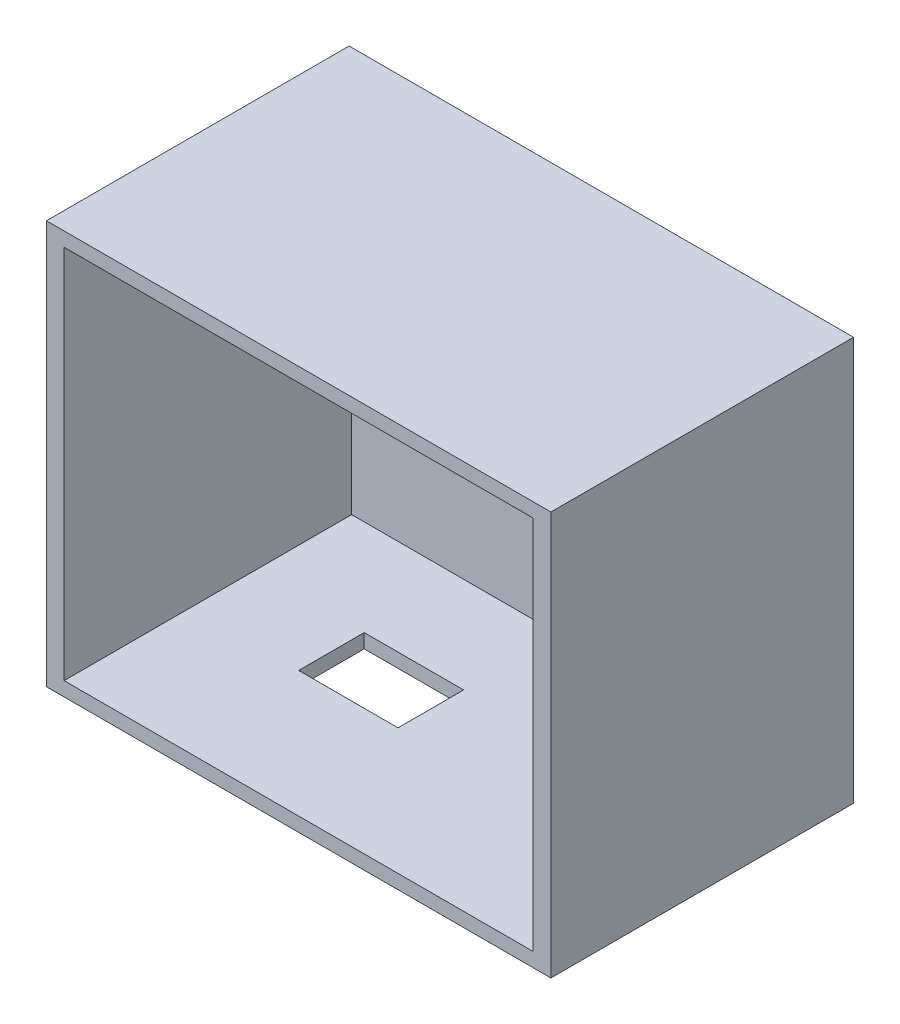
ISO-10303-21;
HEADER;
FILE_DESCRIPTION(('STEP AP214'),'2;1');
FILE_NAME('part.step','',(''),(''),'','','');
FILE_SCHEMA(('AUTOMOTIVE_DESIGN { 1 0 10303 214 1 1 1 1 }'));
ENDSEC;
DATA;
#1=APPLICATION_CONTEXT('core data for automotive mechanical design processes');
#2=APPLICATION_PROTOCOL_DEFINITION('international standard','automotive_design',2000,#1);
#3=PRODUCT_CONTEXT('',#1,'mechanical');
#4=PRODUCT('Part','Part','',(#3));
#5=PRODUCT_RELATED_PRODUCT_CATEGORY('part','',(#4));
#6=PRODUCT_DEFINITION_FORMATION('','',#4);
#7=PRODUCT_DEFINITION_CONTEXT('part definition',#1,'design');
#8=PRODUCT_DEFINITION('design','',#6,#7);
#9=PRODUCT_DEFINITION_SHAPE('','',#8);
#10=(LENGTH_UNIT() NAMED_UNIT(*) SI_UNIT(.MILLI.,.METRE.));
#11=(NAMED_UNIT(*) PLANE_ANGLE_UNIT() SI_UNIT($,.RADIAN.));
#12=(NAMED_UNIT(*) SI_UNIT($,.STERADIAN.) SOLID_ANGLE_UNIT());
#13=UNCERTAINTY_MEASURE_WITH_UNIT(LENGTH_MEASURE(1.E-05),#10,'distance_accuracy_value','');
#14=(GEOMETRIC_REPRESENTATION_CONTEXT(3) GLOBAL_UNCERTAINTY_ASSIGNED_CONTEXT((#13)) GLOBAL_UNIT_ASSIGNED_CONTEXT((#10,
#11,#12)) REPRESENTATION_CONTEXT('',''));
#15=CARTESIAN_POINT('',(0.,0.,0.));
#16=DIRECTION('',(0.,0.,1.));
#17=DIRECTION('',(1.,0.,0.));
#18=AXIS2_PLACEMENT_3D('',#15,#16,#17);
#19=CARTESIAN_POINT('',(0.,0.,3.));
#20=DIRECTION('',(1.,0.,0.));
#21=DIRECTION('',(0.,0.,-1.));
#22=AXIS2_PLACEMENT_3D('',#19,#20,#21);
#23=PLANE('',#22);
#24=DIRECTION('',(0.,-1.,0.));
#25=VECTOR('',#24,1.);
#26=CARTESIAN_POINT('',(0.,0.,0.));
#27=LINE('',#26,#25);
#28=CARTESIAN_POINT('',(0.,80.,0.));
#29=VERTEX_POINT('',#28);
#30=CARTESIAN_POINT('',(0.,0.,0.));
#31=VERTEX_POINT('',#30);
#32=EDGE_CURVE('E156',#29,#31,#27,.T.);
#33=ORIENTED_EDGE('',*,*,#32,.T.);
#34=DIRECTION('',(0.,0.,-1.));
#35=VECTOR('',#34,1.);
#36=CARTESIAN_POINT('',(0.,0.,3.));
#37=LINE('',#36,#35);
#38=CARTESIAN_POINT('',(0.,0.,60.));
#39=VERTEX_POINT('',#38);
#40=EDGE_CURVE('E123',#39,#31,#37,.T.);
#41=ORIENTED_EDGE('',*,*,#40,.F.);
#42=DIRECTION('',(0.,-1.,0.));
#43=VECTOR('',#42,1.);
#44=CARTESIAN_POINT('',(0.,80.,60.));
#45=LINE('',#44,#43);
#46=CARTESIAN_POINT('',(0.,80.,60.));
#47=VERTEX_POINT('',#46);
#48=EDGE_CURVE('E180',#47,#39,#45,.T.);
#49=ORIENTED_EDGE('',*,*,#48,.F.);
#50=DIRECTION('',(0.,0.,-1.));
#51=VECTOR('',#50,1.);
#52=CARTESIAN_POINT('',(0.,80.,3.));
#53=LINE('',#52,#51);
#54=EDGE_CURVE('E147',#47,#29,#53,.T.);
#55=ORIENTED_EDGE('',*,*,#54,.T.);
#56=EDGE_LOOP('',(#33,#41,#49,#55));
#57=FACE_BOUND('',#56,.T.);
#58=ADVANCED_FACE('F33',(#57),#23,.F.);
#59=CARTESIAN_POINT('',(0.,0.,3.));
#60=DIRECTION('',(0.,1.,0.));
#61=DIRECTION('',(0.,0.,1.));
#62=AXIS2_PLACEMENT_3D('',#59,#60,#61);
#63=PLANE('',#62);
#64=DIRECTION('',(-1.,0.,0.));
#65=VECTOR('',#64,1.);
#66=CARTESIAN_POINT('',(0.,0.,22.));
#67=LINE('',#66,#65);
#68=CARTESIAN_POINT('',(44.7,0.,22.));
#69=VERTEX_POINT('',#68);
#70=CARTESIAN_POINT('',(25.,0.,22.));
#71=VERTEX_POINT('',#70);
#72=EDGE_CURVE('E206',#69,#71,#67,.T.);
#73=ORIENTED_EDGE('',*,*,#72,.T.);
#74=DIRECTION('',(0.,0.,1.));
#75=VECTOR('',#74,1.);
#76=CARTESIAN_POINT('',(25.,0.,2.99999999999999));
#77=LINE('',#76,#75);
#78=CARTESIAN_POINT('',(25.,0.,35.));
#79=VERTEX_POINT('',#78);
#80=EDGE_CURVE('E203',#71,#79,#77,.T.);
#81=ORIENTED_EDGE('',*,*,#80,.T.);
#82=DIRECTION('',(1.,0.,0.));
#83=VECTOR('',#82,1.);
#84=CARTESIAN_POINT('',(0.,0.,35.));
#85=LINE('',#84,#83);
#86=CARTESIAN_POINT('',(44.7,0.,35.));
#87=VERTEX_POINT('',#86);
#88=EDGE_CURVE('E210',#79,#87,#85,.T.);
#89=ORIENTED_EDGE('',*,*,#88,.T.);
#90=DIRECTION('',(0.,0.,-1.));
#91=VECTOR('',#90,1.);
#92=CARTESIAN_POINT('',(44.7,0.,3.00000000000002));
#93=LINE('',#92,#91);
#94=EDGE_CURVE('E130',#87,#69,#93,.T.);
#95=ORIENTED_EDGE('',*,*,#94,.T.);
#96=EDGE_LOOP('',(#73,#81,#89,#95));
#97=FACE_BOUND('',#96,.T.);
#98=DIRECTION('',(1.,0.,0.));
#99=VECTOR('',#98,1.);
#100=CARTESIAN_POINT('',(0.,0.,0.));
#101=LINE('',#100,#99);
#102=CARTESIAN_POINT('',(100.,0.,0.));
#103=VERTEX_POINT('',#102);
#104=EDGE_CURVE('E154',#31,#103,#101,.T.);
#105=ORIENTED_EDGE('',*,*,#104,.T.);
#106=DIRECTION('',(0.,0.,-1.));
#107=VECTOR('',#106,1.);
#108=CARTESIAN_POINT('',(100.,0.,3.));
#109=LINE('',#108,#107);
#110=CARTESIAN_POINT('',(100.,0.,60.));
#111=VERTEX_POINT('',#110);
#112=EDGE_CURVE('E141',#111,#103,#109,.T.);
#113=ORIENTED_EDGE('',*,*,#112,.F.);
#114=DIRECTION('',(1.,0.,0.));
#115=VECTOR('',#114,1.);
#116=CARTESIAN_POINT('',(0.,0.,60.));
#117=LINE('',#116,#115);
#118=EDGE_CURVE('E177',#39,#111,#117,.T.);
#119=ORIENTED_EDGE('',*,*,#118,.F.);
#120=ORIENTED_EDGE('',*,*,#40,.T.);
#121=EDGE_LOOP('',(#105,#113,#119,#120));
#122=FACE_BOUND('',#121,.T.);
#123=ADVANCED_FACE('F222',(#97,#122),#63,.F.);
#124=CARTESIAN_POINT('',(100.,0.,3.));
#125=DIRECTION('',(-1.,0.,0.));
#126=DIRECTION('',(0.,0.,1.));
#127=AXIS2_PLACEMENT_3D('',#124,#125,#126);
#128=PLANE('',#127);
#129=DIRECTION('',(0.,1.,0.));
#130=VECTOR('',#129,1.);
#131=CARTESIAN_POINT('',(100.,0.,0.));
#132=LINE('',#131,#130);
#133=CARTESIAN_POINT('',(100.,80.,0.));
#134=VERTEX_POINT('',#133);
#135=EDGE_CURVE('E152',#103,#134,#132,.T.);
#136=ORIENTED_EDGE('',*,*,#135,.T.);
#137=DIRECTION('',(0.,0.,-1.));
#138=VECTOR('',#137,1.);
#139=CARTESIAN_POINT('',(100.,80.,3.));
#140=LINE('',#139,#138);
#141=CARTESIAN_POINT('',(100.,80.,60.));
#142=VERTEX_POINT('',#141);
#143=EDGE_CURVE('E144',#142,#134,#140,.T.);
#144=ORIENTED_EDGE('',*,*,#143,.F.);
#145=DIRECTION('',(0.,1.,0.));
#146=VECTOR('',#145,1.);
#147=CARTESIAN_POINT('',(100.,80.,60.));
#148=LINE('',#147,#146);
#149=EDGE_CURVE('E174',#111,#142,#148,.T.);
#150=ORIENTED_EDGE('',*,*,#149,.F.);
#151=ORIENTED_EDGE('',*,*,#112,.T.);
#152=EDGE_LOOP('',(#136,#144,#150,#151));
#153=FACE_BOUND('',#152,.T.);
#154=ADVANCED_FACE('F225',(#153),#128,.F.);
#155=CARTESIAN_POINT('',(0.,80.,3.));
#156=DIRECTION('',(0.,-1.,0.));
#157=DIRECTION('',(0.,0.,-1.));
#158=AXIS2_PLACEMENT_3D('',#155,#156,#157);
#159=PLANE('',#158);
#160=DIRECTION('',(-1.,0.,0.));
#161=VECTOR('',#160,1.);
#162=CARTESIAN_POINT('',(0.,80.,0.));
#163=LINE('',#162,#161);
#164=EDGE_CURVE('E150',#134,#29,#163,.T.);
#165=ORIENTED_EDGE('',*,*,#164,.T.);
#166=ORIENTED_EDGE('',*,*,#54,.F.);
#167=DIRECTION('',(-1.,0.,0.));
#168=VECTOR('',#167,1.);
#169=CARTESIAN_POINT('',(0.,80.,60.));
#170=LINE('',#169,#168);
#171=EDGE_CURVE('E171',#142,#47,#170,.T.);
#172=ORIENTED_EDGE('',*,*,#171,.F.);
#173=ORIENTED_EDGE('',*,*,#143,.T.);
#174=EDGE_LOOP('',(#165,#166,#172,#173));
#175=FACE_BOUND('',#174,.T.);
#176=ADVANCED_FACE('F235',(#175),#159,.F.);
#177=CARTESIAN_POINT('',(0.,0.,0.));
#178=DIRECTION('',(0.,0.,-1.));
#179=DIRECTION('',(-1.,0.,0.));
#180=AXIS2_PLACEMENT_3D('',#177,#178,#179);
#181=PLANE('',#180);
#182=ORIENTED_EDGE('',*,*,#32,.F.);
#183=ORIENTED_EDGE('',*,*,#164,.F.);
#184=ORIENTED_EDGE('',*,*,#135,.F.);
#185=ORIENTED_EDGE('',*,*,#104,.F.);
#186=EDGE_LOOP('',(#182,#183,#184,#185));
#187=FACE_BOUND('',#186,.T.);
#188=ADVANCED_FACE('F233',(#187),#181,.T.);
#189=CARTESIAN_POINT('',(3.5,77.2,60.));
#190=DIRECTION('',(1.,0.,0.));
#191=DIRECTION('',(0.,0.,-1.));
#192=AXIS2_PLACEMENT_3D('',#189,#190,#191);
#193=PLANE('',#192);
#194=DIRECTION('',(0.,-1.,0.));
#195=VECTOR('',#194,1.);
#196=CARTESIAN_POINT('',(3.5,0.,3.));
#197=LINE('',#196,#195);
#198=CARTESIAN_POINT('',(3.5,77.2,3.));
#199=VERTEX_POINT('',#198);
#200=CARTESIAN_POINT('',(3.5,2.79999999999999,3.));
#201=VERTEX_POINT('',#200);
#202=EDGE_CURVE('E159',#199,#201,#197,.T.);
#203=ORIENTED_EDGE('',*,*,#202,.F.);
#204=DIRECTION('',(0.,0.,-1.));
#205=VECTOR('',#204,1.);
#206=CARTESIAN_POINT('',(3.5,77.2,60.));
#207=LINE('',#206,#205);
#208=CARTESIAN_POINT('',(3.5,77.2,60.));
#209=VERTEX_POINT('',#208);
#210=EDGE_CURVE('E192',#209,#199,#207,.T.);
#211=ORIENTED_EDGE('',*,*,#210,.F.);
#212=DIRECTION('',(0.,-1.,0.));
#213=VECTOR('',#212,1.);
#214=CARTESIAN_POINT('',(3.5,77.2,60.));
#215=LINE('',#214,#213);
#216=CARTESIAN_POINT('',(3.5,2.79999999999999,60.));
#217=VERTEX_POINT('',#216);
#218=EDGE_CURVE('E201',#209,#217,#215,.T.);
#219=ORIENTED_EDGE('',*,*,#218,.T.);
#220=DIRECTION('',(0.,0.,-1.));
#221=VECTOR('',#220,1.);
#222=CARTESIAN_POINT('',(3.5,2.79999999999999,60.));
#223=LINE('',#222,#221);
#224=EDGE_CURVE('E183',#217,#201,#223,.T.);
#225=ORIENTED_EDGE('',*,*,#224,.T.);
#226=EDGE_LOOP('',(#203,#211,#219,#225));
#227=FACE_BOUND('',#226,.T.);
#228=ADVANCED_FACE('F257',(#227),#193,.T.);
#229=CARTESIAN_POINT('',(3.5,2.79999999999999,60.));
#230=DIRECTION('',(0.,1.,0.));
#231=DIRECTION('',(0.,0.,1.));
#232=AXIS2_PLACEMENT_3D('',#229,#230,#231);
#233=PLANE('',#232);
#234=DIRECTION('',(0.,0.,1.));
#235=VECTOR('',#234,1.);
#236=CARTESIAN_POINT('',(25.,2.79999999999999,60.));
#237=LINE('',#236,#235);
#238=CARTESIAN_POINT('',(25.,2.79999999999999,22.));
#239=VERTEX_POINT('',#238);
#240=CARTESIAN_POINT('',(25.,2.79999999999999,35.));
#241=VERTEX_POINT('',#240);
#242=EDGE_CURVE('E11',#239,#241,#237,.T.);
#243=ORIENTED_EDGE('',*,*,#242,.F.);
#244=DIRECTION('',(-1.,0.,0.));
#245=VECTOR('',#244,1.);
#246=CARTESIAN_POINT('',(3.5,2.79999999999999,22.));
#247=LINE('',#246,#245);
#248=CARTESIAN_POINT('',(44.7,2.79999999999999,22.));
#249=VERTEX_POINT('',#248);
#250=EDGE_CURVE('E40',#249,#239,#247,.T.);
#251=ORIENTED_EDGE('',*,*,#250,.F.);
#252=DIRECTION('',(0.,0.,-1.));
#253=VECTOR('',#252,1.);
#254=CARTESIAN_POINT('',(44.7,2.79999999999999,60.));
#255=LINE('',#254,#253);
#256=CARTESIAN_POINT('',(44.7,2.79999999999999,35.));
#257=VERTEX_POINT('',#256);
#258=EDGE_CURVE('E122',#257,#249,#255,.T.);
#259=ORIENTED_EDGE('',*,*,#258,.F.);
#260=DIRECTION('',(1.,0.,0.));
#261=VECTOR('',#260,1.);
#262=CARTESIAN_POINT('',(3.5,2.79999999999999,35.));
#263=LINE('',#262,#261);
#264=EDGE_CURVE('E117',#241,#257,#263,.T.);
#265=ORIENTED_EDGE('',*,*,#264,.F.);
#266=EDGE_LOOP('',(#243,#251,#259,#265));
#267=FACE_BOUND('',#266,.T.);
#268=DIRECTION('',(1.,0.,0.));
#269=VECTOR('',#268,1.);
#270=CARTESIAN_POINT('',(0.,2.79999999999999,3.));
#271=LINE('',#270,#269);
#272=CARTESIAN_POINT('',(96.5,2.79999999999999,3.));
#273=VERTEX_POINT('',#272);
#274=EDGE_CURVE('E162',#201,#273,#271,.T.);
#275=ORIENTED_EDGE('',*,*,#274,.F.);
#276=ORIENTED_EDGE('',*,*,#224,.F.);
#277=DIRECTION('',(1.,0.,0.));
#278=VECTOR('',#277,1.);
#279=CARTESIAN_POINT('',(3.5,2.79999999999999,60.));
#280=LINE('',#279,#278);
#281=CARTESIAN_POINT('',(96.5,2.79999999999999,60.));
#282=VERTEX_POINT('',#281);
#283=EDGE_CURVE('E199',#217,#282,#280,.T.);
#284=ORIENTED_EDGE('',*,*,#283,.T.);
#285=DIRECTION('',(0.,0.,-1.));
#286=VECTOR('',#285,1.);
#287=CARTESIAN_POINT('',(96.5,2.79999999999999,60.));
#288=LINE('',#287,#286);
#289=EDGE_CURVE('E186',#282,#273,#288,.T.);
#290=ORIENTED_EDGE('',*,*,#289,.T.);
#291=EDGE_LOOP('',(#275,#276,#284,#290));
#292=FACE_BOUND('',#291,.T.);
#293=ADVANCED_FACE('F135',(#267,#292),#233,.T.);
#294=CARTESIAN_POINT('',(96.5,77.2,60.));
#295=DIRECTION('',(-1.,0.,0.));
#296=DIRECTION('',(0.,0.,1.));
#297=AXIS2_PLACEMENT_3D('',#294,#295,#296);
#298=PLANE('',#297);
#299=DIRECTION('',(0.,1.,0.));
#300=VECTOR('',#299,1.);
#301=CARTESIAN_POINT('',(96.5,0.,3.));
#302=LINE('',#301,#300);
#303=CARTESIAN_POINT('',(96.5,77.2,3.));
#304=VERTEX_POINT('',#303);
#305=EDGE_CURVE('E165',#273,#304,#302,.T.);
#306=ORIENTED_EDGE('',*,*,#305,.F.);
#307=ORIENTED_EDGE('',*,*,#289,.F.);
#308=DIRECTION('',(0.,1.,0.));
#309=VECTOR('',#308,1.);
#310=CARTESIAN_POINT('',(96.5,77.2,60.));
#311=LINE('',#310,#309);
#312=CARTESIAN_POINT('',(96.5,77.2,60.));
#313=VERTEX_POINT('',#312);
#314=EDGE_CURVE('E196',#282,#313,#311,.T.);
#315=ORIENTED_EDGE('',*,*,#314,.T.);
#316=DIRECTION('',(0.,0.,-1.));
#317=VECTOR('',#316,1.);
#318=CARTESIAN_POINT('',(96.5,77.2,60.));
#319=LINE('',#318,#317);
#320=EDGE_CURVE('E189',#313,#304,#319,.T.);
#321=ORIENTED_EDGE('',*,*,#320,.T.);
#322=EDGE_LOOP('',(#306,#307,#315,#321));
#323=FACE_BOUND('',#322,.T.);
#324=ADVANCED_FACE('F253',(#323),#298,.T.);
#325=CARTESIAN_POINT('',(3.5,77.2,60.));
#326=DIRECTION('',(0.,-1.,0.));
#327=DIRECTION('',(0.,0.,-1.));
#328=AXIS2_PLACEMENT_3D('',#325,#326,#327);
#329=PLANE('',#328);
#330=DIRECTION('',(-1.,0.,0.));
#331=VECTOR('',#330,1.);
#332=CARTESIAN_POINT('',(0.,77.2,3.));
#333=LINE('',#332,#331);
#334=EDGE_CURVE('E168',#304,#199,#333,.T.);
#335=ORIENTED_EDGE('',*,*,#334,.F.);
#336=ORIENTED_EDGE('',*,*,#320,.F.);
#337=DIRECTION('',(-1.,0.,0.));
#338=VECTOR('',#337,1.);
#339=CARTESIAN_POINT('',(3.5,77.2,60.));
#340=LINE('',#339,#338);
#341=EDGE_CURVE('E194',#313,#209,#340,.T.);
#342=ORIENTED_EDGE('',*,*,#341,.T.);
#343=ORIENTED_EDGE('',*,*,#210,.T.);
#344=EDGE_LOOP('',(#335,#336,#342,#343));
#345=FACE_BOUND('',#344,.T.);
#346=ADVANCED_FACE('F244',(#345),#329,.T.);
#347=CARTESIAN_POINT('',(0.,0.,60.));
#348=DIRECTION('',(0.,0.,1.));
#349=DIRECTION('',(1.,0.,0.));
#350=AXIS2_PLACEMENT_3D('',#347,#348,#349);
#351=PLANE('',#350);
#352=ORIENTED_EDGE('',*,*,#48,.T.);
#353=ORIENTED_EDGE('',*,*,#118,.T.);
#354=ORIENTED_EDGE('',*,*,#149,.T.);
#355=ORIENTED_EDGE('',*,*,#171,.T.);
#356=EDGE_LOOP('',(#352,#353,#354,#355));
#357=FACE_BOUND('',#356,.T.);
#358=ORIENTED_EDGE('',*,*,#283,.F.);
#359=ORIENTED_EDGE('',*,*,#218,.F.);
#360=ORIENTED_EDGE('',*,*,#341,.F.);
#361=ORIENTED_EDGE('',*,*,#314,.F.);
#362=EDGE_LOOP('',(#358,#359,#360,#361));
#363=FACE_BOUND('',#362,.T.);
#364=ADVANCED_FACE('F240',(#357,#363),#351,.T.);
#365=CARTESIAN_POINT('',(0.,0.,3.));
#366=DIRECTION('',(0.,0.,-1.));
#367=DIRECTION('',(-1.,0.,0.));
#368=AXIS2_PLACEMENT_3D('',#365,#366,#367);
#369=PLANE('',#368);
#370=ORIENTED_EDGE('',*,*,#334,.T.);
#371=ORIENTED_EDGE('',*,*,#202,.T.);
#372=ORIENTED_EDGE('',*,*,#274,.T.);
#373=ORIENTED_EDGE('',*,*,#305,.T.);
#374=EDGE_LOOP('',(#370,#371,#372,#373));
#375=FACE_BOUND('',#374,.T.);
#376=ADVANCED_FACE('F243',(#375),#369,.F.);
#377=CARTESIAN_POINT('',(25.,-17.,22.));
#378=DIRECTION('',(-1.,0.,0.));
#379=DIRECTION('',(0.,0.,1.));
#380=AXIS2_PLACEMENT_3D('',#377,#378,#379);
#381=PLANE('',#380);
#382=DIRECTION('',(0.,1.,0.));
#383=VECTOR('',#382,1.);
#384=CARTESIAN_POINT('',(25.,-17.,22.));
#385=LINE('',#384,#383);
#386=EDGE_CURVE('E212',#71,#239,#385,.T.);
#387=ORIENTED_EDGE('',*,*,#386,.T.);
#388=ORIENTED_EDGE('',*,*,#242,.T.);
#389=DIRECTION('',(0.,1.,0.));
#390=VECTOR('',#389,1.);
#391=CARTESIAN_POINT('',(25.,-17.,35.));
#392=LINE('',#391,#390);
#393=EDGE_CURVE('E52',#79,#241,#392,.T.);
#394=ORIENTED_EDGE('',*,*,#393,.F.);
#395=ORIENTED_EDGE('',*,*,#80,.F.);
#396=EDGE_LOOP('',(#387,#388,#394,#395));
#397=FACE_BOUND('',#396,.T.);
#398=ADVANCED_FACE('F218',(#397),#381,.F.);
#399=CARTESIAN_POINT('',(25.,-17.,22.));
#400=DIRECTION('',(0.,0.,-1.));
#401=DIRECTION('',(-1.,0.,0.));
#402=AXIS2_PLACEMENT_3D('',#399,#400,#401);
#403=PLANE('',#402);
#404=DIRECTION('',(0.,1.,0.));
#405=VECTOR('',#404,1.);
#406=CARTESIAN_POINT('',(44.7,-17.,22.));
#407=LINE('',#406,#405);
#408=EDGE_CURVE('E132',#69,#249,#407,.T.);
#409=ORIENTED_EDGE('',*,*,#408,.T.);
#410=ORIENTED_EDGE('',*,*,#250,.T.);
#411=ORIENTED_EDGE('',*,*,#386,.F.);
#412=ORIENTED_EDGE('',*,*,#72,.F.);
#413=EDGE_LOOP('',(#409,#410,#411,#412));
#414=FACE_BOUND('',#413,.T.);
#415=ADVANCED_FACE('F220',(#414),#403,.F.);
#416=CARTESIAN_POINT('',(44.7,-17.,22.));
#417=DIRECTION('',(1.,0.,0.));
#418=DIRECTION('',(0.,0.,-1.));
#419=AXIS2_PLACEMENT_3D('',#416,#417,#418);
#420=PLANE('',#419);
#421=DIRECTION('',(0.,1.,0.));
#422=VECTOR('',#421,1.);
#423=CARTESIAN_POINT('',(44.7,-17.,35.));
#424=LINE('',#423,#422);
#425=EDGE_CURVE('E47',#87,#257,#424,.T.);
#426=ORIENTED_EDGE('',*,*,#425,.T.);
#427=ORIENTED_EDGE('',*,*,#258,.T.);
#428=ORIENTED_EDGE('',*,*,#408,.F.);
#429=ORIENTED_EDGE('',*,*,#94,.F.);
#430=EDGE_LOOP('',(#426,#427,#428,#429));
#431=FACE_BOUND('',#430,.T.);
#432=ADVANCED_FACE('F126',(#431),#420,.F.);
#433=CARTESIAN_POINT('',(25.,-17.,35.));
#434=DIRECTION('',(0.,0.,1.));
#435=DIRECTION('',(1.,0.,0.));
#436=AXIS2_PLACEMENT_3D('',#433,#434,#435);
#437=PLANE('',#436);
#438=ORIENTED_EDGE('',*,*,#393,.T.);
#439=ORIENTED_EDGE('',*,*,#264,.T.);
#440=ORIENTED_EDGE('',*,*,#425,.F.);
#441=ORIENTED_EDGE('',*,*,#88,.F.);
#442=EDGE_LOOP('',(#438,#439,#440,#441));
#443=FACE_BOUND('',#442,.T.);
#444=ADVANCED_FACE('F118',(#443),#437,.F.);
#445=CLOSED_SHELL('',(#58,#123,#154,#176,#188,#228,#293,#324,#346,#364,#376,#398,#415,#432,#444));
#446=MANIFOLD_SOLID_BREP('B2',#445);
#447=ADVANCED_BREP_SHAPE_REPRESENTATION('',(#18,#446),#14);
#448=SHAPE_DEFINITION_REPRESENTATION(#9,#447);
ENDSEC;
END-ISO-10303-21;
